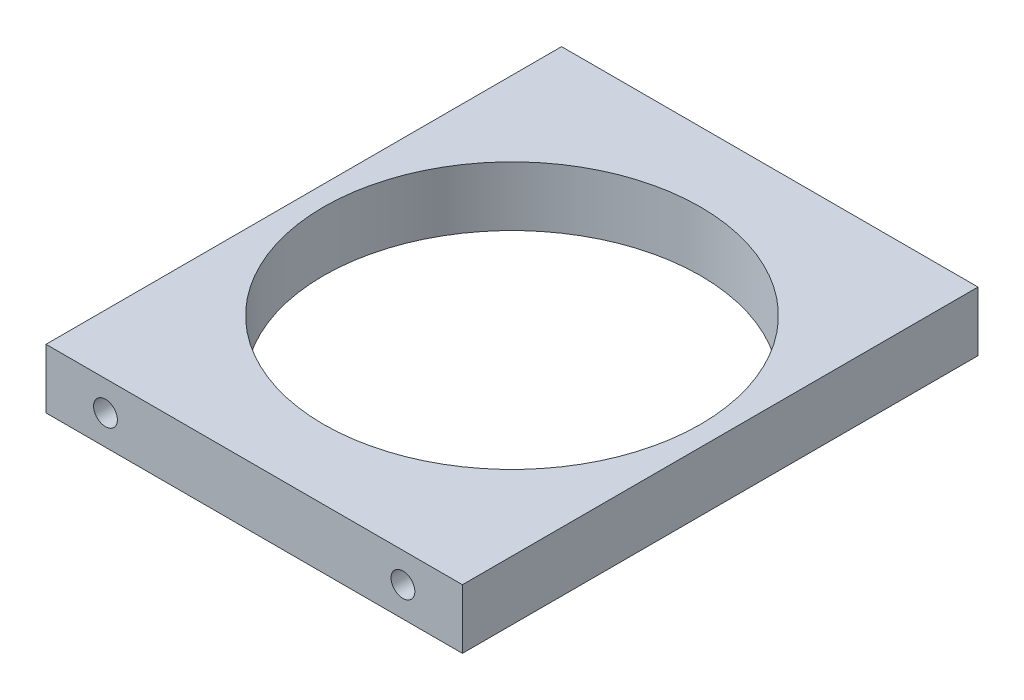
ISO-10303-21;
HEADER;
FILE_DESCRIPTION(('STEP AP214'),'2;1');
FILE_NAME('part.step','',(''),(''),'','','');
FILE_SCHEMA(('AUTOMOTIVE_DESIGN { 1 0 10303 214 1 1 1 1 }'));
ENDSEC;
DATA;
#1=APPLICATION_CONTEXT('core data for automotive mechanical design processes');
#2=APPLICATION_PROTOCOL_DEFINITION('international standard','automotive_design',2000,#1);
#3=PRODUCT_CONTEXT('',#1,'mechanical');
#4=PRODUCT('Part','Part','',(#3));
#5=PRODUCT_RELATED_PRODUCT_CATEGORY('part','',(#4));
#6=PRODUCT_DEFINITION_FORMATION('','',#4);
#7=PRODUCT_DEFINITION_CONTEXT('part definition',#1,'design');
#8=PRODUCT_DEFINITION('design','',#6,#7);
#9=PRODUCT_DEFINITION_SHAPE('','',#8);
#10=(LENGTH_UNIT() NAMED_UNIT(*) SI_UNIT(.MILLI.,.METRE.));
#11=(NAMED_UNIT(*) PLANE_ANGLE_UNIT() SI_UNIT($,.RADIAN.));
#12=(NAMED_UNIT(*) SI_UNIT($,.STERADIAN.) SOLID_ANGLE_UNIT());
#13=UNCERTAINTY_MEASURE_WITH_UNIT(LENGTH_MEASURE(1.E-05),#10,'distance_accuracy_value','');
#14=(GEOMETRIC_REPRESENTATION_CONTEXT(3) GLOBAL_UNCERTAINTY_ASSIGNED_CONTEXT((#13)) GLOBAL_UNIT_ASSIGNED_CONTEXT((#10,
#11,#12)) REPRESENTATION_CONTEXT('',''));
#15=CARTESIAN_POINT('',(0.,0.,0.));
#16=DIRECTION('',(0.,0.,1.));
#17=DIRECTION('',(1.,0.,0.));
#18=AXIS2_PLACEMENT_3D('',#15,#16,#17);
#19=CARTESIAN_POINT('',(-21.,3.,26.));
#20=DIRECTION('',(1.,0.,0.));
#21=DIRECTION('',(0.,0.,-1.));
#22=AXIS2_PLACEMENT_3D('',#19,#20,#21);
#23=PLANE('',#22);
#24=DIRECTION('',(0.,0.,1.));
#25=VECTOR('',#24,1.);
#26=CARTESIAN_POINT('',(-21.,-3.,26.));
#27=LINE('',#26,#25);
#28=CARTESIAN_POINT('',(-21.,-3.,-26.));
#29=VERTEX_POINT('',#28);
#30=CARTESIAN_POINT('',(-21.,-3.,26.));
#31=VERTEX_POINT('',#30);
#32=EDGE_CURVE('E96',#29,#31,#27,.T.);
#33=ORIENTED_EDGE('',*,*,#32,.T.);
#34=DIRECTION('',(0.,-1.,0.));
#35=VECTOR('',#34,1.);
#36=CARTESIAN_POINT('',(-21.,3.,26.));
#37=LINE('',#36,#35);
#38=CARTESIAN_POINT('',(-21.,3.,26.));
#39=VERTEX_POINT('',#38);
#40=EDGE_CURVE('E11',#39,#31,#37,.T.);
#41=ORIENTED_EDGE('',*,*,#40,.F.);
#42=DIRECTION('',(0.,0.,1.));
#43=VECTOR('',#42,1.);
#44=CARTESIAN_POINT('',(-21.,3.,26.));
#45=LINE('',#44,#43);
#46=CARTESIAN_POINT('',(-21.,3.,-26.));
#47=VERTEX_POINT('',#46);
#48=EDGE_CURVE('E84',#47,#39,#45,.T.);
#49=ORIENTED_EDGE('',*,*,#48,.F.);
#50=DIRECTION('',(0.,-1.,0.));
#51=VECTOR('',#50,1.);
#52=CARTESIAN_POINT('',(-21.,3.,-26.));
#53=LINE('',#52,#51);
#54=EDGE_CURVE('E92',#47,#29,#53,.T.);
#55=ORIENTED_EDGE('',*,*,#54,.T.);
#56=EDGE_LOOP('',(#33,#41,#49,#55));
#57=FACE_BOUND('',#56,.T.);
#58=ADVANCED_FACE('F33',(#57),#23,.F.);
#59=CARTESIAN_POINT('',(21.,3.,26.));
#60=DIRECTION('',(0.,0.,-1.));
#61=DIRECTION('',(-1.,0.,0.));
#62=AXIS2_PLACEMENT_3D('',#59,#60,#61);
#63=PLANE('',#62);
#64=CARTESIAN_POINT('',(-15.,0.,26.));
#65=DIRECTION('',(0.,0.,1.));
#66=DIRECTION('',(1.,0.,0.));
#67=AXIS2_PLACEMENT_3D('',#64,#65,#66);
#68=CIRCLE('',#67,1.2);
#69=CARTESIAN_POINT('',(-13.8,0.,26.));
#70=VERTEX_POINT('',#69);
#71=EDGE_CURVE('E134',#70,#70,#68,.T.);
#72=ORIENTED_EDGE('',*,*,#71,.F.);
#73=EDGE_LOOP('',(#72));
#74=FACE_BOUND('',#73,.T.);
#75=CARTESIAN_POINT('',(15.,0.,26.));
#76=DIRECTION('',(0.,0.,1.));
#77=DIRECTION('',(1.,0.,0.));
#78=AXIS2_PLACEMENT_3D('',#75,#76,#77);
#79=CIRCLE('',#78,1.2);
#80=CARTESIAN_POINT('',(16.2,0.,26.));
#81=VERTEX_POINT('',#80);
#82=EDGE_CURVE('E128',#81,#81,#79,.T.);
#83=ORIENTED_EDGE('',*,*,#82,.F.);
#84=EDGE_LOOP('',(#83));
#85=FACE_BOUND('',#84,.T.);
#86=DIRECTION('',(1.,0.,0.));
#87=VECTOR('',#86,1.);
#88=CARTESIAN_POINT('',(21.,-3.,26.));
#89=LINE('',#88,#87);
#90=CARTESIAN_POINT('',(21.,-3.,26.));
#91=VERTEX_POINT('',#90);
#92=EDGE_CURVE('E88',#31,#91,#89,.T.);
#93=ORIENTED_EDGE('',*,*,#92,.T.);
#94=DIRECTION('',(0.,-1.,0.));
#95=VECTOR('',#94,1.);
#96=CARTESIAN_POINT('',(21.,3.,26.));
#97=LINE('',#96,#95);
#98=CARTESIAN_POINT('',(21.,3.,26.));
#99=VERTEX_POINT('',#98);
#100=EDGE_CURVE('E41',#99,#91,#97,.T.);
#101=ORIENTED_EDGE('',*,*,#100,.F.);
#102=DIRECTION('',(1.,0.,0.));
#103=VECTOR('',#102,1.);
#104=CARTESIAN_POINT('',(21.,3.,26.));
#105=LINE('',#104,#103);
#106=EDGE_CURVE('E79',#39,#99,#105,.T.);
#107=ORIENTED_EDGE('',*,*,#106,.F.);
#108=ORIENTED_EDGE('',*,*,#40,.T.);
#109=EDGE_LOOP('',(#93,#101,#107,#108));
#110=FACE_BOUND('',#109,.T.);
#111=ADVANCED_FACE('F87',(#74,#85,#110),#63,.F.);
#112=CARTESIAN_POINT('',(21.,3.,26.));
#113=DIRECTION('',(-1.,0.,0.));
#114=DIRECTION('',(0.,0.,1.));
#115=AXIS2_PLACEMENT_3D('',#112,#113,#114);
#116=PLANE('',#115);
#117=DIRECTION('',(0.,0.,-1.));
#118=VECTOR('',#117,1.);
#119=CARTESIAN_POINT('',(21.,-3.,26.));
#120=LINE('',#119,#118);
#121=CARTESIAN_POINT('',(21.,-3.,-26.));
#122=VERTEX_POINT('',#121);
#123=EDGE_CURVE('E66',#91,#122,#120,.T.);
#124=ORIENTED_EDGE('',*,*,#123,.T.);
#125=DIRECTION('',(0.,-1.,0.));
#126=VECTOR('',#125,1.);
#127=CARTESIAN_POINT('',(21.,3.,-26.));
#128=LINE('',#127,#126);
#129=CARTESIAN_POINT('',(21.,3.,-26.));
#130=VERTEX_POINT('',#129);
#131=EDGE_CURVE('E89',#130,#122,#128,.T.);
#132=ORIENTED_EDGE('',*,*,#131,.F.);
#133=DIRECTION('',(0.,0.,-1.));
#134=VECTOR('',#133,1.);
#135=CARTESIAN_POINT('',(21.,3.,26.));
#136=LINE('',#135,#134);
#137=EDGE_CURVE('E82',#99,#130,#136,.T.);
#138=ORIENTED_EDGE('',*,*,#137,.F.);
#139=ORIENTED_EDGE('',*,*,#100,.T.);
#140=EDGE_LOOP('',(#124,#132,#138,#139));
#141=FACE_BOUND('',#140,.T.);
#142=ADVANCED_FACE('F90',(#141),#116,.F.);
#143=CARTESIAN_POINT('',(21.,3.,-26.));
#144=DIRECTION('',(0.,0.,1.));
#145=DIRECTION('',(1.,0.,0.));
#146=AXIS2_PLACEMENT_3D('',#143,#144,#145);
#147=PLANE('',#146);
#148=CARTESIAN_POINT('',(-15.,0.,-26.));
#149=DIRECTION('',(0.,0.,-1.));
#150=DIRECTION('',(1.,0.,0.));
#151=AXIS2_PLACEMENT_3D('',#148,#149,#150);
#152=CIRCLE('',#151,1.2);
#153=CARTESIAN_POINT('',(-13.8,0.,-26.));
#154=VERTEX_POINT('',#153);
#155=EDGE_CURVE('E122',#154,#154,#152,.T.);
#156=ORIENTED_EDGE('',*,*,#155,.F.);
#157=EDGE_LOOP('',(#156));
#158=FACE_BOUND('',#157,.T.);
#159=CARTESIAN_POINT('',(15.,0.,-26.));
#160=DIRECTION('',(0.,0.,-1.));
#161=DIRECTION('',(-1.,0.,0.));
#162=AXIS2_PLACEMENT_3D('',#159,#160,#161);
#163=CIRCLE('',#162,1.2);
#164=CARTESIAN_POINT('',(13.8,0.,-26.));
#165=VERTEX_POINT('',#164);
#166=EDGE_CURVE('E116',#165,#165,#163,.T.);
#167=ORIENTED_EDGE('',*,*,#166,.F.);
#168=EDGE_LOOP('',(#167));
#169=FACE_BOUND('',#168,.T.);
#170=DIRECTION('',(-1.,0.,0.));
#171=VECTOR('',#170,1.);
#172=CARTESIAN_POINT('',(21.,-3.,-26.));
#173=LINE('',#172,#171);
#174=EDGE_CURVE('E72',#122,#29,#173,.T.);
#175=ORIENTED_EDGE('',*,*,#174,.T.);
#176=ORIENTED_EDGE('',*,*,#54,.F.);
#177=DIRECTION('',(-1.,0.,0.));
#178=VECTOR('',#177,1.);
#179=CARTESIAN_POINT('',(21.,3.,-26.));
#180=LINE('',#179,#178);
#181=EDGE_CURVE('E49',#130,#47,#180,.T.);
#182=ORIENTED_EDGE('',*,*,#181,.F.);
#183=ORIENTED_EDGE('',*,*,#131,.T.);
#184=EDGE_LOOP('',(#175,#176,#182,#183));
#185=FACE_BOUND('',#184,.T.);
#186=ADVANCED_FACE('F104',(#158,#169,#185),#147,.F.);
#187=CARTESIAN_POINT('',(0.,3.,0.));
#188=DIRECTION('',(0.,1.,0.));
#189=DIRECTION('',(0.,0.,1.));
#190=AXIS2_PLACEMENT_3D('',#187,#188,#189);
#191=PLANE('',#190);
#192=CARTESIAN_POINT('',(0.,3.,0.));
#193=DIRECTION('',(0.,1.,0.));
#194=DIRECTION('',(0.,0.,1.));
#195=AXIS2_PLACEMENT_3D('',#192,#193,#194);
#196=CIRCLE('',#195,19.);
#197=CARTESIAN_POINT('',(0.,3.,19.));
#198=VERTEX_POINT('',#197);
#199=EDGE_CURVE('E110',#198,#198,#196,.T.);
#200=ORIENTED_EDGE('',*,*,#199,.F.);
#201=EDGE_LOOP('',(#200));
#202=FACE_BOUND('',#201,.T.);
#203=ORIENTED_EDGE('',*,*,#48,.T.);
#204=ORIENTED_EDGE('',*,*,#106,.T.);
#205=ORIENTED_EDGE('',*,*,#137,.T.);
#206=ORIENTED_EDGE('',*,*,#181,.T.);
#207=EDGE_LOOP('',(#203,#204,#205,#206));
#208=FACE_BOUND('',#207,.T.);
#209=ADVANCED_FACE('F80',(#202,#208),#191,.T.);
#210=CARTESIAN_POINT('',(0.,-3.,0.));
#211=DIRECTION('',(0.,1.,0.));
#212=DIRECTION('',(0.,0.,1.));
#213=AXIS2_PLACEMENT_3D('',#210,#211,#212);
#214=PLANE('',#213);
#215=CARTESIAN_POINT('',(0.,-3.,0.));
#216=DIRECTION('',(0.,1.,0.));
#217=DIRECTION('',(0.,0.,1.));
#218=AXIS2_PLACEMENT_3D('',#215,#216,#217);
#219=CIRCLE('',#218,19.);
#220=CARTESIAN_POINT('',(0.,-3.,19.));
#221=VERTEX_POINT('',#220);
#222=EDGE_CURVE('E99',#221,#221,#219,.T.);
#223=ORIENTED_EDGE('',*,*,#222,.T.);
#224=EDGE_LOOP('',(#223));
#225=FACE_BOUND('',#224,.T.);
#226=ORIENTED_EDGE('',*,*,#32,.F.);
#227=ORIENTED_EDGE('',*,*,#174,.F.);
#228=ORIENTED_EDGE('',*,*,#123,.F.);
#229=ORIENTED_EDGE('',*,*,#92,.F.);
#230=EDGE_LOOP('',(#226,#227,#228,#229));
#231=FACE_BOUND('',#230,.T.);
#232=ADVANCED_FACE('F107',(#225,#231),#214,.F.);
#233=CARTESIAN_POINT('',(0.,-3.,0.));
#234=DIRECTION('',(0.,1.,0.));
#235=DIRECTION('',(0.,0.,1.));
#236=AXIS2_PLACEMENT_3D('',#233,#234,#235);
#237=CYLINDRICAL_SURFACE('',#236,19.);
#238=ORIENTED_EDGE('',*,*,#222,.F.);
#239=EDGE_LOOP('',(#238));
#240=FACE_BOUND('',#239,.T.);
#241=ORIENTED_EDGE('',*,*,#199,.T.);
#242=EDGE_LOOP('',(#241));
#243=FACE_BOUND('',#242,.T.);
#244=ADVANCED_FACE('F204',(#240,#243),#237,.F.);
#245=CARTESIAN_POINT('',(15.,0.,-18.));
#246=DIRECTION('',(0.,0.,-1.));
#247=DIRECTION('',(-1.,0.,0.));
#248=AXIS2_PLACEMENT_3D('',#245,#246,#247);
#249=CYLINDRICAL_SURFACE('',#248,1.2);
#250=CARTESIAN_POINT('',(15.,0.,-18.));
#251=DIRECTION('',(0.,0.,-1.));
#252=DIRECTION('',(-1.,0.,0.));
#253=AXIS2_PLACEMENT_3D('',#250,#251,#252);
#254=CIRCLE('',#253,1.2);
#255=CARTESIAN_POINT('',(13.8,0.,-18.));
#256=VERTEX_POINT('',#255);
#257=EDGE_CURVE('E113',#256,#256,#254,.T.);
#258=ORIENTED_EDGE('',*,*,#257,.F.);
#259=EDGE_LOOP('',(#258));
#260=FACE_BOUND('',#259,.T.);
#261=ORIENTED_EDGE('',*,*,#166,.T.);
#262=EDGE_LOOP('',(#261));
#263=FACE_BOUND('',#262,.T.);
#264=ADVANCED_FACE('F211',(#260,#263),#249,.F.);
#265=CARTESIAN_POINT('',(15.,0.,-18.));
#266=DIRECTION('',(0.,0.,-1.));
#267=DIRECTION('',(-1.,0.,0.));
#268=AXIS2_PLACEMENT_3D('',#265,#266,#267);
#269=PLANE('',#268);
#270=ORIENTED_EDGE('',*,*,#257,.T.);
#271=EDGE_LOOP('',(#270));
#272=FACE_BOUND('',#271,.T.);
#273=ADVANCED_FACE('F218',(#272),#269,.T.);
#274=CARTESIAN_POINT('',(-15.,0.,-18.));
#275=DIRECTION('',(0.,0.,-1.));
#276=DIRECTION('',(-1.,0.,0.));
#277=AXIS2_PLACEMENT_3D('',#274,#275,#276);
#278=CYLINDRICAL_SURFACE('',#277,1.2);
#279=CARTESIAN_POINT('',(-15.,0.,-18.));
#280=DIRECTION('',(0.,0.,-1.));
#281=DIRECTION('',(1.,0.,0.));
#282=AXIS2_PLACEMENT_3D('',#279,#280,#281);
#283=CIRCLE('',#282,1.2);
#284=CARTESIAN_POINT('',(-13.8,0.,-18.));
#285=VERTEX_POINT('',#284);
#286=EDGE_CURVE('E119',#285,#285,#283,.T.);
#287=ORIENTED_EDGE('',*,*,#286,.F.);
#288=EDGE_LOOP('',(#287));
#289=FACE_BOUND('',#288,.T.);
#290=ORIENTED_EDGE('',*,*,#155,.T.);
#291=EDGE_LOOP('',(#290));
#292=FACE_BOUND('',#291,.T.);
#293=ADVANCED_FACE('F164',(#289,#292),#278,.F.);
#294=CARTESIAN_POINT('',(-15.,0.,-18.));
#295=DIRECTION('',(0.,0.,1.));
#296=DIRECTION('',(1.,0.,0.));
#297=AXIS2_PLACEMENT_3D('',#294,#295,#296);
#298=PLANE('',#297);
#299=ORIENTED_EDGE('',*,*,#286,.T.);
#300=EDGE_LOOP('',(#299));
#301=FACE_BOUND('',#300,.T.);
#302=ADVANCED_FACE('F155',(#301),#298,.F.);
#303=CARTESIAN_POINT('',(15.,0.,18.));
#304=DIRECTION('',(0.,0.,1.));
#305=DIRECTION('',(1.,0.,0.));
#306=AXIS2_PLACEMENT_3D('',#303,#304,#305);
#307=CYLINDRICAL_SURFACE('',#306,1.2);
#308=CARTESIAN_POINT('',(15.,0.,18.));
#309=DIRECTION('',(0.,0.,1.));
#310=DIRECTION('',(1.,0.,0.));
#311=AXIS2_PLACEMENT_3D('',#308,#309,#310);
#312=CIRCLE('',#311,1.2);
#313=CARTESIAN_POINT('',(16.2,0.,18.));
#314=VERTEX_POINT('',#313);
#315=EDGE_CURVE('E125',#314,#314,#312,.T.);
#316=ORIENTED_EDGE('',*,*,#315,.F.);
#317=EDGE_LOOP('',(#316));
#318=FACE_BOUND('',#317,.T.);
#319=ORIENTED_EDGE('',*,*,#82,.T.);
#320=EDGE_LOOP('',(#319));
#321=FACE_BOUND('',#320,.T.);
#322=ADVANCED_FACE('F153',(#318,#321),#307,.F.);
#323=CARTESIAN_POINT('',(15.,0.,18.));
#324=DIRECTION('',(0.,0.,1.));
#325=DIRECTION('',(1.,0.,0.));
#326=AXIS2_PLACEMENT_3D('',#323,#324,#325);
#327=PLANE('',#326);
#328=ORIENTED_EDGE('',*,*,#315,.T.);
#329=EDGE_LOOP('',(#328));
#330=FACE_BOUND('',#329,.T.);
#331=ADVANCED_FACE('F145',(#330),#327,.T.);
#332=CARTESIAN_POINT('',(-15.,0.,18.));
#333=DIRECTION('',(0.,0.,1.));
#334=DIRECTION('',(1.,0.,0.));
#335=AXIS2_PLACEMENT_3D('',#332,#333,#334);
#336=CYLINDRICAL_SURFACE('',#335,1.2);
#337=CARTESIAN_POINT('',(-15.,0.,18.));
#338=DIRECTION('',(0.,0.,1.));
#339=DIRECTION('',(1.,0.,0.));
#340=AXIS2_PLACEMENT_3D('',#337,#338,#339);
#341=CIRCLE('',#340,1.2);
#342=CARTESIAN_POINT('',(-13.8,0.,18.));
#343=VERTEX_POINT('',#342);
#344=EDGE_CURVE('E131',#343,#343,#341,.T.);
#345=ORIENTED_EDGE('',*,*,#344,.F.);
#346=EDGE_LOOP('',(#345));
#347=FACE_BOUND('',#346,.T.);
#348=ORIENTED_EDGE('',*,*,#71,.T.);
#349=EDGE_LOOP('',(#348));
#350=FACE_BOUND('',#349,.T.);
#351=ADVANCED_FACE('F142',(#347,#350),#336,.F.);
#352=CARTESIAN_POINT('',(-15.,0.,18.));
#353=DIRECTION('',(0.,0.,1.));
#354=DIRECTION('',(1.,0.,0.));
#355=AXIS2_PLACEMENT_3D('',#352,#353,#354);
#356=PLANE('',#355);
#357=ORIENTED_EDGE('',*,*,#344,.T.);
#358=EDGE_LOOP('',(#357));
#359=FACE_BOUND('',#358,.T.);
#360=ADVANCED_FACE('F140',(#359),#356,.T.);
#361=CLOSED_SHELL('',(#58,#111,#142,#186,#209,#232,#244,#264,#273,#293,#302,#322,#331,#351,#360));
#362=MANIFOLD_SOLID_BREP('B2',#361);
#363=ADVANCED_BREP_SHAPE_REPRESENTATION('',(#18,#362),#14);
#364=SHAPE_DEFINITION_REPRESENTATION(#9,#363);
ENDSEC;
END-ISO-10303-21;
